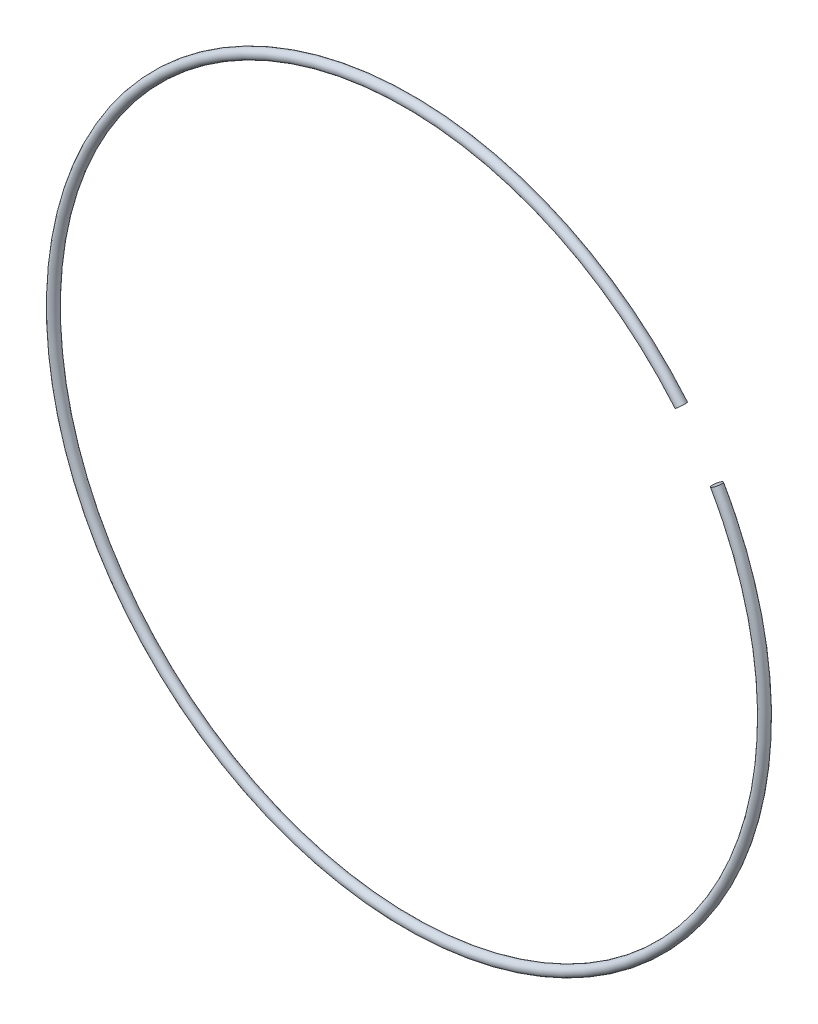
ISO-10303-21;
HEADER;
FILE_DESCRIPTION(('STEP AP214'),'2;1');
FILE_NAME('part.step','',(''),(''),'','','');
FILE_SCHEMA(('AUTOMOTIVE_DESIGN { 1 0 10303 214 1 1 1 1 }'));
ENDSEC;
DATA;
#1=APPLICATION_CONTEXT('core data for automotive mechanical design processes');
#2=APPLICATION_PROTOCOL_DEFINITION('international standard','automotive_design',2000,#1);
#3=PRODUCT_CONTEXT('',#1,'mechanical');
#4=PRODUCT('Part','Part','',(#3));
#5=PRODUCT_RELATED_PRODUCT_CATEGORY('part','',(#4));
#6=PRODUCT_DEFINITION_FORMATION('','',#4);
#7=PRODUCT_DEFINITION_CONTEXT('part definition',#1,'design');
#8=PRODUCT_DEFINITION('design','',#6,#7);
#9=PRODUCT_DEFINITION_SHAPE('','',#8);
#10=(LENGTH_UNIT() NAMED_UNIT(*) SI_UNIT(.MILLI.,.METRE.));
#11=(NAMED_UNIT(*) PLANE_ANGLE_UNIT() SI_UNIT($,.RADIAN.));
#12=(NAMED_UNIT(*) SI_UNIT($,.STERADIAN.) SOLID_ANGLE_UNIT());
#13=UNCERTAINTY_MEASURE_WITH_UNIT(LENGTH_MEASURE(1.E-05),#10,'distance_accuracy_value','');
#14=(GEOMETRIC_REPRESENTATION_CONTEXT(3) GLOBAL_UNCERTAINTY_ASSIGNED_CONTEXT((#13)) GLOBAL_UNIT_ASSIGNED_CONTEXT((#10,
#11,#12)) REPRESENTATION_CONTEXT('',''));
#15=CARTESIAN_POINT('',(0.,0.,0.));
#16=DIRECTION('',(0.,0.,1.));
#17=DIRECTION('',(1.,0.,0.));
#18=AXIS2_PLACEMENT_3D('',#15,#16,#17);
#19=CARTESIAN_POINT('',(87.5588798484993,73.4706237871713,0.));
#20=DIRECTION('',(-0.642787609686538,0.766044443118979,0.));
#21=DIRECTION('',(-0.766044443118979,-0.642787609686538,0.));
#22=AXIS2_PLACEMENT_3D('',#19,#20,#21);
#23=PLANE('',#22);
#24=CARTESIAN_POINT('',(87.5588798484993,73.4706237871713,0.));
#25=DIRECTION('',(-0.642787609686538,0.766044443118979,0.));
#26=DIRECTION('',(-0.766044443118979,-0.642787609686538,0.));
#27=AXIS2_PLACEMENT_3D('',#24,#25,#26);
#28=CIRCLE('',#27,1.5875);
#29=CARTESIAN_POINT('',(86.3427842950479,72.4501984567939,0.));
#30=VERTEX_POINT('',#29);
#31=EDGE_CURVE('E40',#30,#30,#28,.T.);
#32=ORIENTED_EDGE('',*,*,#31,.F.);
#33=EDGE_LOOP('',(#32));
#34=FACE_BOUND('',#33,.T.);
#35=ADVANCED_FACE('F33',(#34),#23,.F.);
#36=CARTESIAN_POINT('',(98.9867036525615,57.1499999999998,0.));
#37=DIRECTION('',(-0.499999999999998,0.86602540378444,0.));
#38=DIRECTION('',(-0.86602540378444,-0.499999999999998,0.));
#39=AXIS2_PLACEMENT_3D('',#36,#37,#38);
#40=PLANE('',#39);
#41=CARTESIAN_POINT('',(98.9867036525615,57.1499999999998,0.));
#42=DIRECTION('',(-0.499999999999998,0.86602540378444,0.));
#43=DIRECTION('',(-0.86602540378444,-0.499999999999998,0.));
#44=AXIS2_PLACEMENT_3D('',#41,#42,#43);
#45=CIRCLE('',#44,1.5875);
#46=CARTESIAN_POINT('',(97.6118883240537,56.3562499999998,0.));
#47=VERTEX_POINT('',#46);
#48=EDGE_CURVE('E11',#47,#47,#45,.T.);
#49=ORIENTED_EDGE('',*,*,#48,.T.);
#50=EDGE_LOOP('',(#49));
#51=FACE_BOUND('',#50,.T.);
#52=ADVANCED_FACE('F47',(#51),#40,.T.);
#53=CARTESIAN_POINT('',(0.,0.,0.));
#54=DIRECTION('',(0.,0.,1.));
#55=DIRECTION('',(1.,0.,0.));
#56=AXIS2_PLACEMENT_3D('',#53,#54,#55);
#57=TOROIDAL_SURFACE('',#56,114.3,1.5875);
#58=ORIENTED_EDGE('',*,*,#48,.F.);
#59=EDGE_LOOP('',(#58));
#60=FACE_BOUND('',#59,.T.);
#61=ORIENTED_EDGE('',*,*,#31,.T.);
#62=EDGE_LOOP('',(#61));
#63=FACE_BOUND('',#62,.T.);
#64=ADVANCED_FACE('F49',(#60,#63),#57,.T.);
#65=CLOSED_SHELL('',(#35,#52,#64));
#66=MANIFOLD_SOLID_BREP('B2',#65);
#67=ADVANCED_BREP_SHAPE_REPRESENTATION('',(#18,#66),#14);
#68=SHAPE_DEFINITION_REPRESENTATION(#9,#67);
ENDSEC;
END-ISO-10303-21;
